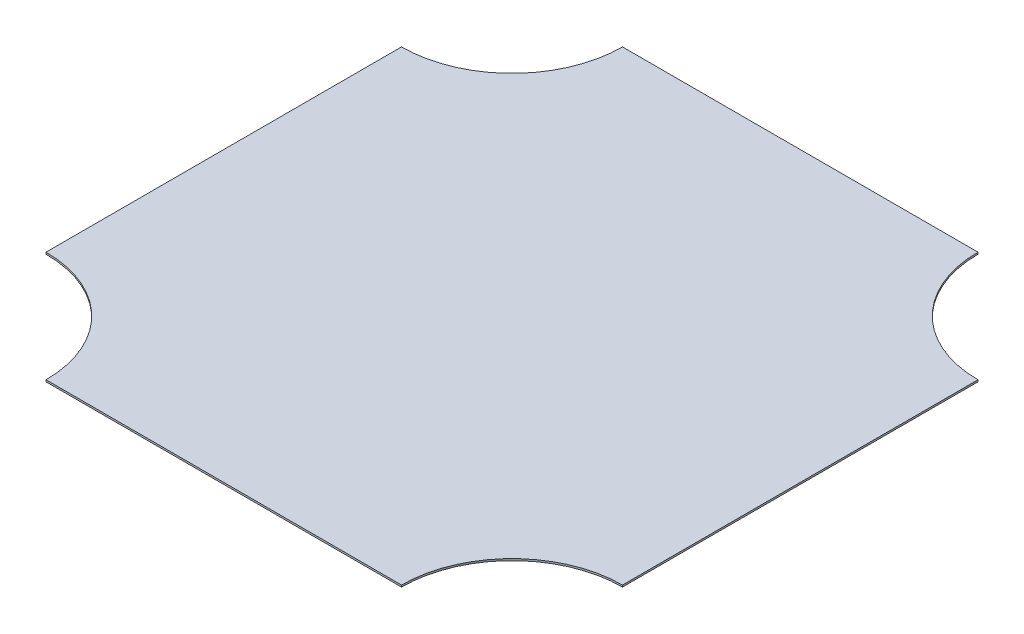
ISO-10303-21;
HEADER;
FILE_DESCRIPTION(('STEP AP214'),'2;1');
FILE_NAME('part.step','',(''),(''),'','','');
FILE_SCHEMA(('AUTOMOTIVE_DESIGN { 1 0 10303 214 1 1 1 1 }'));
ENDSEC;
DATA;
#1=APPLICATION_CONTEXT('core data for automotive mechanical design processes');
#2=APPLICATION_PROTOCOL_DEFINITION('international standard','automotive_design',2000,#1);
#3=PRODUCT_CONTEXT('',#1,'mechanical');
#4=PRODUCT('Part','Part','',(#3));
#5=PRODUCT_RELATED_PRODUCT_CATEGORY('part','',(#4));
#6=PRODUCT_DEFINITION_FORMATION('','',#4);
#7=PRODUCT_DEFINITION_CONTEXT('part definition',#1,'design');
#8=PRODUCT_DEFINITION('design','',#6,#7);
#9=PRODUCT_DEFINITION_SHAPE('','',#8);
#10=(LENGTH_UNIT() NAMED_UNIT(*) SI_UNIT(.MILLI.,.METRE.));
#11=(NAMED_UNIT(*) PLANE_ANGLE_UNIT() SI_UNIT($,.RADIAN.));
#12=(NAMED_UNIT(*) SI_UNIT($,.STERADIAN.) SOLID_ANGLE_UNIT());
#13=UNCERTAINTY_MEASURE_WITH_UNIT(LENGTH_MEASURE(1.E-05),#10,'distance_accuracy_value','');
#14=(GEOMETRIC_REPRESENTATION_CONTEXT(3) GLOBAL_UNCERTAINTY_ASSIGNED_CONTEXT((#13)) GLOBAL_UNIT_ASSIGNED_CONTEXT((#10,
#11,#12)) REPRESENTATION_CONTEXT('',''));
#15=CARTESIAN_POINT('',(0.,0.,0.));
#16=DIRECTION('',(0.,0.,1.));
#17=DIRECTION('',(1.,0.,0.));
#18=AXIS2_PLACEMENT_3D('',#15,#16,#17);
#19=CARTESIAN_POINT('',(381.,2.38125,-381.));
#20=DIRECTION('',(-1.,0.,0.));
#21=DIRECTION('',(0.,0.,1.));
#22=AXIS2_PLACEMENT_3D('',#19,#20,#21);
#23=PLANE('',#22);
#24=DIRECTION('',(0.,0.,-1.));
#25=VECTOR('',#24,1.);
#26=CARTESIAN_POINT('',(381.,2.38125,-381.));
#27=LINE('',#26,#25);
#28=CARTESIAN_POINT('',(380.999999999999,2.38125,234.950000000001));
#29=VERTEX_POINT('',#28);
#30=CARTESIAN_POINT('',(381.,2.38125,-234.95));
#31=VERTEX_POINT('',#30);
#32=EDGE_CURVE('E117',#29,#31,#27,.T.);
#33=ORIENTED_EDGE('',*,*,#32,.F.);
#34=DIRECTION('',(0.,1.,0.));
#35=VECTOR('',#34,1.);
#36=CARTESIAN_POINT('',(380.999999999999,0.,234.950000000001));
#37=LINE('',#36,#35);
#38=CARTESIAN_POINT('',(380.999999999999,0.,234.950000000001));
#39=VERTEX_POINT('',#38);
#40=EDGE_CURVE('E101',#39,#29,#37,.T.);
#41=ORIENTED_EDGE('',*,*,#40,.F.);
#42=DIRECTION('',(0.,0.,-1.));
#43=VECTOR('',#42,1.);
#44=CARTESIAN_POINT('',(381.,0.,-381.));
#45=LINE('',#44,#43);
#46=CARTESIAN_POINT('',(381.,0.,-234.95));
#47=VERTEX_POINT('',#46);
#48=EDGE_CURVE('E115',#39,#47,#45,.T.);
#49=ORIENTED_EDGE('',*,*,#48,.T.);
#50=DIRECTION('',(0.,1.,0.));
#51=VECTOR('',#50,1.);
#52=CARTESIAN_POINT('',(381.,0.,-234.95));
#53=LINE('',#52,#51);
#54=EDGE_CURVE('E131',#47,#31,#53,.T.);
#55=ORIENTED_EDGE('',*,*,#54,.T.);
#56=EDGE_LOOP('',(#33,#41,#49,#55));
#57=FACE_BOUND('',#56,.T.);
#58=ADVANCED_FACE('F33',(#57),#23,.F.);
#59=CARTESIAN_POINT('',(-381.,2.38125,-381.));
#60=DIRECTION('',(0.,0.,1.));
#61=DIRECTION('',(1.,0.,0.));
#62=AXIS2_PLACEMENT_3D('',#59,#60,#61);
#63=PLANE('',#62);
#64=DIRECTION('',(-1.,0.,0.));
#65=VECTOR('',#64,1.);
#66=CARTESIAN_POINT('',(-381.,0.,-381.));
#67=LINE('',#66,#65);
#68=CARTESIAN_POINT('',(234.95,0.,-381.));
#69=VERTEX_POINT('',#68);
#70=CARTESIAN_POINT('',(-234.949999999996,0.,-381.));
#71=VERTEX_POINT('',#70);
#72=EDGE_CURVE('E125',#69,#71,#67,.T.);
#73=ORIENTED_EDGE('',*,*,#72,.T.);
#74=DIRECTION('',(0.,1.,0.));
#75=VECTOR('',#74,1.);
#76=CARTESIAN_POINT('',(-234.949999999996,0.,-381.000000000003));
#77=LINE('',#76,#75);
#78=CARTESIAN_POINT('',(-234.949999999996,2.38125,-381.000000000003));
#79=VERTEX_POINT('',#78);
#80=EDGE_CURVE('E49',#71,#79,#77,.T.);
#81=ORIENTED_EDGE('',*,*,#80,.T.);
#82=DIRECTION('',(-1.,0.,0.));
#83=VECTOR('',#82,1.);
#84=CARTESIAN_POINT('',(-381.,2.38125,-381.));
#85=LINE('',#84,#83);
#86=CARTESIAN_POINT('',(234.95,2.38125,-381.));
#87=VERTEX_POINT('',#86);
#88=EDGE_CURVE('E139',#87,#79,#85,.T.);
#89=ORIENTED_EDGE('',*,*,#88,.F.);
#90=DIRECTION('',(0.,1.,0.));
#91=VECTOR('',#90,1.);
#92=CARTESIAN_POINT('',(234.95,0.,-381.));
#93=LINE('',#92,#91);
#94=EDGE_CURVE('E126',#69,#87,#93,.T.);
#95=ORIENTED_EDGE('',*,*,#94,.F.);
#96=EDGE_LOOP('',(#73,#81,#89,#95));
#97=FACE_BOUND('',#96,.T.);
#98=ADVANCED_FACE('F174',(#97),#63,.F.);
#99=CARTESIAN_POINT('',(-381.,2.38125,-381.));
#100=DIRECTION('',(1.,0.,0.));
#101=DIRECTION('',(0.,0.,-1.));
#102=AXIS2_PLACEMENT_3D('',#99,#100,#101);
#103=PLANE('',#102);
#104=DIRECTION('',(0.,0.,1.));
#105=VECTOR('',#104,1.);
#106=CARTESIAN_POINT('',(-381.,2.38125,-381.));
#107=LINE('',#106,#105);
#108=CARTESIAN_POINT('',(-380.999999999998,2.38125,-234.950000000004));
#109=VERTEX_POINT('',#108);
#110=CARTESIAN_POINT('',(-381.000000000002,2.38125,234.949999999997));
#111=VERTEX_POINT('',#110);
#112=EDGE_CURVE('E41',#109,#111,#107,.T.);
#113=ORIENTED_EDGE('',*,*,#112,.F.);
#114=DIRECTION('',(0.,1.,0.));
#115=VECTOR('',#114,1.);
#116=CARTESIAN_POINT('',(-380.999999999998,0.,-234.950000000004));
#117=LINE('',#116,#115);
#118=CARTESIAN_POINT('',(-380.999999999998,0.,-234.950000000004));
#119=VERTEX_POINT('',#118);
#120=EDGE_CURVE('E155',#119,#109,#117,.T.);
#121=ORIENTED_EDGE('',*,*,#120,.F.);
#122=DIRECTION('',(0.,0.,1.));
#123=VECTOR('',#122,1.);
#124=CARTESIAN_POINT('',(-381.,0.,-381.));
#125=LINE('',#124,#123);
#126=CARTESIAN_POINT('',(-381.,0.,234.949999999997));
#127=VERTEX_POINT('',#126);
#128=EDGE_CURVE('E129',#119,#127,#125,.T.);
#129=ORIENTED_EDGE('',*,*,#128,.T.);
#130=DIRECTION('',(0.,1.,0.));
#131=VECTOR('',#130,1.);
#132=CARTESIAN_POINT('',(-381.000000000002,0.,234.949999999997));
#133=LINE('',#132,#131);
#134=EDGE_CURVE('E57',#127,#111,#133,.T.);
#135=ORIENTED_EDGE('',*,*,#134,.T.);
#136=EDGE_LOOP('',(#113,#121,#129,#135));
#137=FACE_BOUND('',#136,.T.);
#138=ADVANCED_FACE('F154',(#137),#103,.F.);
#139=CARTESIAN_POINT('',(-381.,2.38125,381.));
#140=DIRECTION('',(0.,0.,-1.));
#141=DIRECTION('',(-1.,0.,0.));
#142=AXIS2_PLACEMENT_3D('',#139,#140,#141);
#143=PLANE('',#142);
#144=DIRECTION('',(1.,0.,0.));
#145=VECTOR('',#144,1.);
#146=CARTESIAN_POINT('',(-381.,2.38125,381.));
#147=LINE('',#146,#145);
#148=CARTESIAN_POINT('',(-234.950000000003,2.38125,380.999999999998));
#149=VERTEX_POINT('',#148);
#150=CARTESIAN_POINT('',(234.949999999999,2.38125,381.000000000001));
#151=VERTEX_POINT('',#150);
#152=EDGE_CURVE('E11',#149,#151,#147,.T.);
#153=ORIENTED_EDGE('',*,*,#152,.F.);
#154=DIRECTION('',(0.,1.,0.));
#155=VECTOR('',#154,1.);
#156=CARTESIAN_POINT('',(-234.950000000003,0.,380.999999999998));
#157=LINE('',#156,#155);
#158=CARTESIAN_POINT('',(-234.950000000003,0.,380.999999999998));
#159=VERTEX_POINT('',#158);
#160=EDGE_CURVE('E156',#159,#149,#157,.T.);
#161=ORIENTED_EDGE('',*,*,#160,.F.);
#162=DIRECTION('',(1.,0.,0.));
#163=VECTOR('',#162,1.);
#164=CARTESIAN_POINT('',(-381.,0.,381.));
#165=LINE('',#164,#163);
#166=CARTESIAN_POINT('',(234.949999999999,0.,381.));
#167=VERTEX_POINT('',#166);
#168=EDGE_CURVE('E36',#159,#167,#165,.T.);
#169=ORIENTED_EDGE('',*,*,#168,.T.);
#170=DIRECTION('',(0.,1.,0.));
#171=VECTOR('',#170,1.);
#172=CARTESIAN_POINT('',(234.949999999999,0.,381.000000000001));
#173=LINE('',#172,#171);
#174=EDGE_CURVE('E104',#167,#151,#173,.T.);
#175=ORIENTED_EDGE('',*,*,#174,.T.);
#176=EDGE_LOOP('',(#153,#161,#169,#175));
#177=FACE_BOUND('',#176,.T.);
#178=ADVANCED_FACE('F191',(#177),#143,.F.);
#179=CARTESIAN_POINT('',(0.,2.38125,0.));
#180=DIRECTION('',(0.,1.,0.));
#181=DIRECTION('',(0.,0.,1.));
#182=AXIS2_PLACEMENT_3D('',#179,#180,#181);
#183=PLANE('',#182);
#184=CARTESIAN_POINT('',(-380.999999999996,2.38125,-381.000000000004));
#185=DIRECTION('',(0.,1.,0.));
#186=DIRECTION('',(0.,0.,1.));
#187=AXIS2_PLACEMENT_3D('',#184,#185,#186);
#188=CIRCLE('',#187,146.05);
#189=EDGE_CURVE('E153',#109,#79,#188,.T.);
#190=ORIENTED_EDGE('',*,*,#189,.F.);
#191=ORIENTED_EDGE('',*,*,#112,.T.);
#192=CARTESIAN_POINT('',(-381.000000000003,2.38125,380.999999999997));
#193=DIRECTION('',(0.,1.,0.));
#194=DIRECTION('',(0.,0.,1.));
#195=AXIS2_PLACEMENT_3D('',#192,#193,#194);
#196=CIRCLE('',#195,146.05);
#197=EDGE_CURVE('E151',#149,#111,#196,.T.);
#198=ORIENTED_EDGE('',*,*,#197,.F.);
#199=ORIENTED_EDGE('',*,*,#152,.T.);
#200=CARTESIAN_POINT('',(380.999999999999,2.38125,381.000000000001));
#201=DIRECTION('',(0.,1.,0.));
#202=DIRECTION('',(0.,0.,1.));
#203=AXIS2_PLACEMENT_3D('',#200,#201,#202);
#204=CIRCLE('',#203,146.05);
#205=EDGE_CURVE('E109',#29,#151,#204,.T.);
#206=ORIENTED_EDGE('',*,*,#205,.F.);
#207=ORIENTED_EDGE('',*,*,#32,.T.);
#208=CARTESIAN_POINT('',(381.,2.38125,-381.));
#209=DIRECTION('',(0.,1.,0.));
#210=DIRECTION('',(0.,0.,1.));
#211=AXIS2_PLACEMENT_3D('',#208,#209,#210);
#212=CIRCLE('',#211,146.05);
#213=EDGE_CURVE('E118',#87,#31,#212,.T.);
#214=ORIENTED_EDGE('',*,*,#213,.F.);
#215=ORIENTED_EDGE('',*,*,#88,.T.);
#216=EDGE_LOOP('',(#190,#191,#198,#199,#206,#207,#214,#215));
#217=FACE_BOUND('',#216,.T.);
#218=ADVANCED_FACE('F150',(#217),#183,.T.);
#219=CARTESIAN_POINT('',(0.,0.,0.));
#220=DIRECTION('',(0.,1.,0.));
#221=DIRECTION('',(0.,0.,1.));
#222=AXIS2_PLACEMENT_3D('',#219,#220,#221);
#223=PLANE('',#222);
#224=ORIENTED_EDGE('',*,*,#128,.F.);
#225=CARTESIAN_POINT('',(-380.999999999996,0.,-381.000000000004));
#226=DIRECTION('',(0.,1.,0.));
#227=DIRECTION('',(0.,0.,1.));
#228=AXIS2_PLACEMENT_3D('',#225,#226,#227);
#229=CIRCLE('',#228,146.05);
#230=EDGE_CURVE('E163',#119,#71,#229,.T.);
#231=ORIENTED_EDGE('',*,*,#230,.T.);
#232=ORIENTED_EDGE('',*,*,#72,.F.);
#233=CARTESIAN_POINT('',(381.,0.,-381.));
#234=DIRECTION('',(0.,1.,0.));
#235=DIRECTION('',(0.,0.,1.));
#236=AXIS2_PLACEMENT_3D('',#233,#234,#235);
#237=CIRCLE('',#236,146.05);
#238=EDGE_CURVE('E124',#69,#47,#237,.T.);
#239=ORIENTED_EDGE('',*,*,#238,.T.);
#240=ORIENTED_EDGE('',*,*,#48,.F.);
#241=CARTESIAN_POINT('',(380.999999999999,0.,381.000000000001));
#242=DIRECTION('',(0.,1.,0.));
#243=DIRECTION('',(0.,0.,1.));
#244=AXIS2_PLACEMENT_3D('',#241,#242,#243);
#245=CIRCLE('',#244,146.05);
#246=EDGE_CURVE('E98',#39,#167,#245,.T.);
#247=ORIENTED_EDGE('',*,*,#246,.T.);
#248=ORIENTED_EDGE('',*,*,#168,.F.);
#249=CARTESIAN_POINT('',(-381.000000000003,0.,380.999999999997));
#250=DIRECTION('',(0.,1.,0.));
#251=DIRECTION('',(0.,0.,1.));
#252=AXIS2_PLACEMENT_3D('',#249,#250,#251);
#253=CIRCLE('',#252,146.05);
#254=EDGE_CURVE('E157',#159,#127,#253,.T.);
#255=ORIENTED_EDGE('',*,*,#254,.T.);
#256=EDGE_LOOP('',(#224,#231,#232,#239,#240,#247,#248,#255));
#257=FACE_BOUND('',#256,.T.);
#258=ADVANCED_FACE('F122',(#257),#223,.F.);
#259=CARTESIAN_POINT('',(381.,0.,-381.));
#260=DIRECTION('',(0.,1.,0.));
#261=DIRECTION('',(0.,0.,1.));
#262=AXIS2_PLACEMENT_3D('',#259,#260,#261);
#263=CYLINDRICAL_SURFACE('',#262,146.05);
#264=ORIENTED_EDGE('',*,*,#213,.T.);
#265=ORIENTED_EDGE('',*,*,#54,.F.);
#266=ORIENTED_EDGE('',*,*,#238,.F.);
#267=ORIENTED_EDGE('',*,*,#94,.T.);
#268=EDGE_LOOP('',(#264,#265,#266,#267));
#269=FACE_BOUND('',#268,.T.);
#270=ADVANCED_FACE('F170',(#269),#263,.F.);
#271=CARTESIAN_POINT('',(380.999999999999,0.,381.000000000001));
#272=DIRECTION('',(0.,1.,0.));
#273=DIRECTION('',(0.,0.,1.));
#274=AXIS2_PLACEMENT_3D('',#271,#272,#273);
#275=CYLINDRICAL_SURFACE('',#274,146.05);
#276=ORIENTED_EDGE('',*,*,#205,.T.);
#277=ORIENTED_EDGE('',*,*,#174,.F.);
#278=ORIENTED_EDGE('',*,*,#246,.F.);
#279=ORIENTED_EDGE('',*,*,#40,.T.);
#280=EDGE_LOOP('',(#276,#277,#278,#279));
#281=FACE_BOUND('',#280,.T.);
#282=ADVANCED_FACE('F100',(#281),#275,.F.);
#283=CARTESIAN_POINT('',(-381.000000000003,0.,380.999999999997));
#284=DIRECTION('',(0.,1.,0.));
#285=DIRECTION('',(0.,0.,1.));
#286=AXIS2_PLACEMENT_3D('',#283,#284,#285);
#287=CYLINDRICAL_SURFACE('',#286,146.05);
#288=ORIENTED_EDGE('',*,*,#197,.T.);
#289=ORIENTED_EDGE('',*,*,#134,.F.);
#290=ORIENTED_EDGE('',*,*,#254,.F.);
#291=ORIENTED_EDGE('',*,*,#160,.T.);
#292=EDGE_LOOP('',(#288,#289,#290,#291));
#293=FACE_BOUND('',#292,.T.);
#294=ADVANCED_FACE('F177',(#293),#287,.F.);
#295=CARTESIAN_POINT('',(-380.999999999996,0.,-381.000000000004));
#296=DIRECTION('',(0.,1.,0.));
#297=DIRECTION('',(0.,0.,1.));
#298=AXIS2_PLACEMENT_3D('',#295,#296,#297);
#299=CYLINDRICAL_SURFACE('',#298,146.05);
#300=ORIENTED_EDGE('',*,*,#189,.T.);
#301=ORIENTED_EDGE('',*,*,#80,.F.);
#302=ORIENTED_EDGE('',*,*,#230,.F.);
#303=ORIENTED_EDGE('',*,*,#120,.T.);
#304=EDGE_LOOP('',(#300,#301,#302,#303));
#305=FACE_BOUND('',#304,.T.);
#306=ADVANCED_FACE('F175',(#305),#299,.F.);
#307=CLOSED_SHELL('',(#58,#98,#138,#178,#218,#258,#270,#282,#294,#306));
#308=MANIFOLD_SOLID_BREP('B2',#307);
#309=ADVANCED_BREP_SHAPE_REPRESENTATION('',(#18,#308),#14);
#310=SHAPE_DEFINITION_REPRESENTATION(#9,#309);
ENDSEC;
END-ISO-10303-21;
